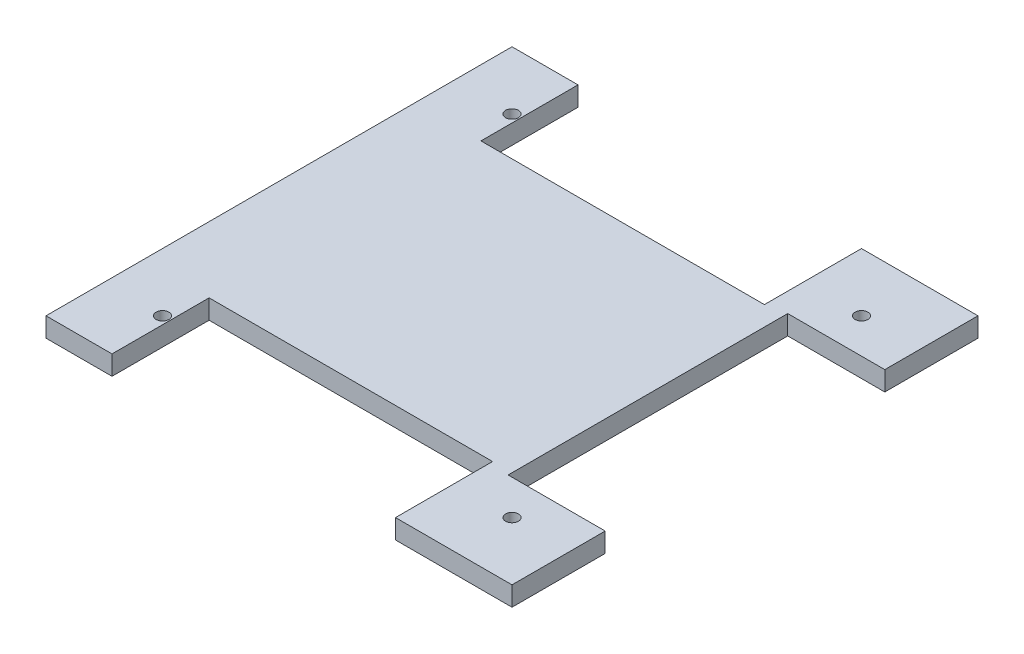
ISO-10303-21;
HEADER;
FILE_DESCRIPTION(('STEP AP214'),'2;1');
FILE_NAME('part.step','',(''),(''),'','','');
FILE_SCHEMA(('AUTOMOTIVE_DESIGN { 1 0 10303 214 1 1 1 1 }'));
ENDSEC;
DATA;
#1=APPLICATION_CONTEXT('core data for automotive mechanical design processes');
#2=APPLICATION_PROTOCOL_DEFINITION('international standard','automotive_design',2000,#1);
#3=PRODUCT_CONTEXT('',#1,'mechanical');
#4=PRODUCT('Part','Part','',(#3));
#5=PRODUCT_RELATED_PRODUCT_CATEGORY('part','',(#4));
#6=PRODUCT_DEFINITION_FORMATION('','',#4);
#7=PRODUCT_DEFINITION_CONTEXT('part definition',#1,'design');
#8=PRODUCT_DEFINITION('design','',#6,#7);
#9=PRODUCT_DEFINITION_SHAPE('','',#8);
#10=(LENGTH_UNIT() NAMED_UNIT(*) SI_UNIT(.MILLI.,.METRE.));
#11=(NAMED_UNIT(*) PLANE_ANGLE_UNIT() SI_UNIT($,.RADIAN.));
#12=(NAMED_UNIT(*) SI_UNIT($,.STERADIAN.) SOLID_ANGLE_UNIT());
#13=UNCERTAINTY_MEASURE_WITH_UNIT(LENGTH_MEASURE(1.E-05),#10,'distance_accuracy_value','');
#14=(GEOMETRIC_REPRESENTATION_CONTEXT(3) GLOBAL_UNCERTAINTY_ASSIGNED_CONTEXT((#13)) GLOBAL_UNIT_ASSIGNED_CONTEXT((#10,
#11,#12)) REPRESENTATION_CONTEXT('',''));
#15=CARTESIAN_POINT('',(0.,0.,0.));
#16=DIRECTION('',(0.,0.,1.));
#17=DIRECTION('',(1.,0.,0.));
#18=AXIS2_PLACEMENT_3D('',#15,#16,#17);
#19=CARTESIAN_POINT('',(60.,5.,-36.));
#20=DIRECTION('',(-1.,0.,0.));
#21=DIRECTION('',(0.,0.,1.));
#22=AXIS2_PLACEMENT_3D('',#19,#20,#21);
#23=PLANE('',#22);
#24=DIRECTION('',(0.,0.,-1.));
#25=VECTOR('',#24,1.);
#26=CARTESIAN_POINT('',(60.,0.,-36.));
#27=LINE('',#26,#25);
#28=CARTESIAN_POINT('',(60.,0.,-36.));
#29=VERTEX_POINT('',#28);
#30=CARTESIAN_POINT('',(60.,0.,-60.));
#31=VERTEX_POINT('',#30);
#32=EDGE_CURVE('E176',#29,#31,#27,.T.);
#33=ORIENTED_EDGE('',*,*,#32,.T.);
#34=DIRECTION('',(0.,-1.,0.));
#35=VECTOR('',#34,1.);
#36=CARTESIAN_POINT('',(60.,5.,-60.));
#37=LINE('',#36,#35);
#38=CARTESIAN_POINT('',(60.,5.,-60.));
#39=VERTEX_POINT('',#38);
#40=EDGE_CURVE('E11',#39,#31,#37,.T.);
#41=ORIENTED_EDGE('',*,*,#40,.F.);
#42=DIRECTION('',(0.,0.,-1.));
#43=VECTOR('',#42,1.);
#44=CARTESIAN_POINT('',(60.,5.,-36.));
#45=LINE('',#44,#43);
#46=CARTESIAN_POINT('',(60.,5.,-36.));
#47=VERTEX_POINT('',#46);
#48=EDGE_CURVE('E207',#47,#39,#45,.T.);
#49=ORIENTED_EDGE('',*,*,#48,.F.);
#50=DIRECTION('',(0.,-1.,0.));
#51=VECTOR('',#50,1.);
#52=CARTESIAN_POINT('',(60.,5.,-36.));
#53=LINE('',#52,#51);
#54=EDGE_CURVE('E172',#47,#29,#53,.T.);
#55=ORIENTED_EDGE('',*,*,#54,.T.);
#56=EDGE_LOOP('',(#33,#41,#49,#55));
#57=FACE_BOUND('',#56,.T.);
#58=ADVANCED_FACE('F32',(#57),#23,.F.);
#59=CARTESIAN_POINT('',(30.,5.,-60.));
#60=DIRECTION('',(0.,0.,1.));
#61=DIRECTION('',(1.,0.,0.));
#62=AXIS2_PLACEMENT_3D('',#59,#60,#61);
#63=PLANE('',#62);
#64=DIRECTION('',(-1.,0.,0.));
#65=VECTOR('',#64,1.);
#66=CARTESIAN_POINT('',(30.,0.,-60.));
#67=LINE('',#66,#65);
#68=CARTESIAN_POINT('',(30.,0.,-60.));
#69=VERTEX_POINT('',#68);
#70=EDGE_CURVE('E179',#31,#69,#67,.T.);
#71=ORIENTED_EDGE('',*,*,#70,.T.);
#72=DIRECTION('',(0.,-1.,0.));
#73=VECTOR('',#72,1.);
#74=CARTESIAN_POINT('',(30.,5.,-60.));
#75=LINE('',#74,#73);
#76=CARTESIAN_POINT('',(30.,5.,-60.));
#77=VERTEX_POINT('',#76);
#78=EDGE_CURVE('E40',#77,#69,#75,.T.);
#79=ORIENTED_EDGE('',*,*,#78,.F.);
#80=DIRECTION('',(-1.,0.,0.));
#81=VECTOR('',#80,1.);
#82=CARTESIAN_POINT('',(30.,5.,-60.));
#83=LINE('',#82,#81);
#84=EDGE_CURVE('E115',#39,#77,#83,.T.);
#85=ORIENTED_EDGE('',*,*,#84,.F.);
#86=ORIENTED_EDGE('',*,*,#40,.T.);
#87=EDGE_LOOP('',(#71,#79,#85,#86));
#88=FACE_BOUND('',#87,.T.);
#89=ADVANCED_FACE('F306',(#88),#63,.F.);
#90=CARTESIAN_POINT('',(30.,5.,-35.));
#91=DIRECTION('',(1.,0.,0.));
#92=DIRECTION('',(0.,0.,-1.));
#93=AXIS2_PLACEMENT_3D('',#90,#91,#92);
#94=PLANE('',#93);
#95=DIRECTION('',(0.,0.,1.));
#96=VECTOR('',#95,1.);
#97=CARTESIAN_POINT('',(30.,0.,-35.));
#98=LINE('',#97,#96);
#99=CARTESIAN_POINT('',(30.,0.,-35.));
#100=VERTEX_POINT('',#99);
#101=EDGE_CURVE('E182',#69,#100,#98,.T.);
#102=ORIENTED_EDGE('',*,*,#101,.T.);
#103=DIRECTION('',(0.,-1.,0.));
#104=VECTOR('',#103,1.);
#105=CARTESIAN_POINT('',(30.,5.,-35.));
#106=LINE('',#105,#104);
#107=CARTESIAN_POINT('',(30.,5.,-35.));
#108=VERTEX_POINT('',#107);
#109=EDGE_CURVE('E238',#108,#100,#106,.T.);
#110=ORIENTED_EDGE('',*,*,#109,.F.);
#111=DIRECTION('',(0.,0.,1.));
#112=VECTOR('',#111,1.);
#113=CARTESIAN_POINT('',(30.,5.,-35.));
#114=LINE('',#113,#112);
#115=EDGE_CURVE('E246',#77,#108,#114,.T.);
#116=ORIENTED_EDGE('',*,*,#115,.F.);
#117=ORIENTED_EDGE('',*,*,#78,.T.);
#118=EDGE_LOOP('',(#102,#110,#116,#117));
#119=FACE_BOUND('',#118,.T.);
#120=ADVANCED_FACE('F244',(#119),#94,.F.);
#121=CARTESIAN_POINT('',(-43.,5.,-35.));
#122=DIRECTION('',(0.,0.,1.));
#123=DIRECTION('',(1.,0.,0.));
#124=AXIS2_PLACEMENT_3D('',#121,#122,#123);
#125=PLANE('',#124);
#126=DIRECTION('',(-1.,0.,0.));
#127=VECTOR('',#126,1.);
#128=CARTESIAN_POINT('',(-43.,0.,-35.));
#129=LINE('',#128,#127);
#130=CARTESIAN_POINT('',(-43.,0.,-35.));
#131=VERTEX_POINT('',#130);
#132=EDGE_CURVE('E184',#100,#131,#129,.T.);
#133=ORIENTED_EDGE('',*,*,#132,.T.);
#134=DIRECTION('',(0.,-1.,0.));
#135=VECTOR('',#134,1.);
#136=CARTESIAN_POINT('',(-43.,5.,-35.));
#137=LINE('',#136,#135);
#138=CARTESIAN_POINT('',(-43.,5.,-35.));
#139=VERTEX_POINT('',#138);
#140=EDGE_CURVE('E235',#139,#131,#137,.T.);
#141=ORIENTED_EDGE('',*,*,#140,.F.);
#142=DIRECTION('',(-1.,0.,0.));
#143=VECTOR('',#142,1.);
#144=CARTESIAN_POINT('',(-43.,5.,-35.));
#145=LINE('',#144,#143);
#146=EDGE_CURVE('E264',#108,#139,#145,.T.);
#147=ORIENTED_EDGE('',*,*,#146,.F.);
#148=ORIENTED_EDGE('',*,*,#109,.T.);
#149=EDGE_LOOP('',(#133,#141,#147,#148));
#150=FACE_BOUND('',#149,.T.);
#151=ADVANCED_FACE('F255',(#150),#125,.F.);
#152=CARTESIAN_POINT('',(-43.,5.,-60.));
#153=DIRECTION('',(-1.,0.,0.));
#154=DIRECTION('',(0.,0.,1.));
#155=AXIS2_PLACEMENT_3D('',#152,#153,#154);
#156=PLANE('',#155);
#157=DIRECTION('',(0.,0.,-1.));
#158=VECTOR('',#157,1.);
#159=CARTESIAN_POINT('',(-43.,0.,-60.));
#160=LINE('',#159,#158);
#161=CARTESIAN_POINT('',(-43.,0.,-60.));
#162=VERTEX_POINT('',#161);
#163=EDGE_CURVE('E186',#131,#162,#160,.T.);
#164=ORIENTED_EDGE('',*,*,#163,.T.);
#165=DIRECTION('',(0.,-1.,0.));
#166=VECTOR('',#165,1.);
#167=CARTESIAN_POINT('',(-43.,5.,-60.));
#168=LINE('',#167,#166);
#169=CARTESIAN_POINT('',(-43.,5.,-60.));
#170=VERTEX_POINT('',#169);
#171=EDGE_CURVE('E232',#170,#162,#168,.T.);
#172=ORIENTED_EDGE('',*,*,#171,.F.);
#173=DIRECTION('',(0.,0.,-1.));
#174=VECTOR('',#173,1.);
#175=CARTESIAN_POINT('',(-43.,5.,-60.));
#176=LINE('',#175,#174);
#177=EDGE_CURVE('E261',#139,#170,#176,.T.);
#178=ORIENTED_EDGE('',*,*,#177,.F.);
#179=ORIENTED_EDGE('',*,*,#140,.T.);
#180=EDGE_LOOP('',(#164,#172,#178,#179));
#181=FACE_BOUND('',#180,.T.);
#182=ADVANCED_FACE('F259',(#181),#156,.F.);
#183=CARTESIAN_POINT('',(-60.,5.,-60.));
#184=DIRECTION('',(0.,0.,1.));
#185=DIRECTION('',(1.,0.,0.));
#186=AXIS2_PLACEMENT_3D('',#183,#184,#185);
#187=PLANE('',#186);
#188=DIRECTION('',(-1.,0.,0.));
#189=VECTOR('',#188,1.);
#190=CARTESIAN_POINT('',(-60.,0.,-60.));
#191=LINE('',#190,#189);
#192=CARTESIAN_POINT('',(-60.,0.,-60.));
#193=VERTEX_POINT('',#192);
#194=EDGE_CURVE('E188',#162,#193,#191,.T.);
#195=ORIENTED_EDGE('',*,*,#194,.T.);
#196=DIRECTION('',(0.,-1.,0.));
#197=VECTOR('',#196,1.);
#198=CARTESIAN_POINT('',(-60.,5.,-60.));
#199=LINE('',#198,#197);
#200=CARTESIAN_POINT('',(-60.,5.,-60.));
#201=VERTEX_POINT('',#200);
#202=EDGE_CURVE('E229',#201,#193,#199,.T.);
#203=ORIENTED_EDGE('',*,*,#202,.F.);
#204=DIRECTION('',(-1.,0.,0.));
#205=VECTOR('',#204,1.);
#206=CARTESIAN_POINT('',(-60.,5.,-60.));
#207=LINE('',#206,#205);
#208=EDGE_CURVE('E263',#170,#201,#207,.T.);
#209=ORIENTED_EDGE('',*,*,#208,.F.);
#210=ORIENTED_EDGE('',*,*,#171,.T.);
#211=EDGE_LOOP('',(#195,#203,#209,#210));
#212=FACE_BOUND('',#211,.T.);
#213=ADVANCED_FACE('F319',(#212),#187,.F.);
#214=CARTESIAN_POINT('',(-60.,5.,60.));
#215=DIRECTION('',(1.,0.,0.));
#216=DIRECTION('',(0.,0.,-1.));
#217=AXIS2_PLACEMENT_3D('',#214,#215,#216);
#218=PLANE('',#217);
#219=DIRECTION('',(0.,0.,1.));
#220=VECTOR('',#219,1.);
#221=CARTESIAN_POINT('',(-60.,0.,60.));
#222=LINE('',#221,#220);
#223=CARTESIAN_POINT('',(-60.,0.,60.));
#224=VERTEX_POINT('',#223);
#225=EDGE_CURVE('E190',#193,#224,#222,.T.);
#226=ORIENTED_EDGE('',*,*,#225,.T.);
#227=DIRECTION('',(0.,-1.,0.));
#228=VECTOR('',#227,1.);
#229=CARTESIAN_POINT('',(-60.,5.,60.));
#230=LINE('',#229,#228);
#231=CARTESIAN_POINT('',(-60.,5.,60.));
#232=VERTEX_POINT('',#231);
#233=EDGE_CURVE('E226',#232,#224,#230,.T.);
#234=ORIENTED_EDGE('',*,*,#233,.F.);
#235=DIRECTION('',(0.,0.,1.));
#236=VECTOR('',#235,1.);
#237=CARTESIAN_POINT('',(-60.,5.,60.));
#238=LINE('',#237,#236);
#239=EDGE_CURVE('E266',#201,#232,#238,.T.);
#240=ORIENTED_EDGE('',*,*,#239,.F.);
#241=ORIENTED_EDGE('',*,*,#202,.T.);
#242=EDGE_LOOP('',(#226,#234,#240,#241));
#243=FACE_BOUND('',#242,.T.);
#244=ADVANCED_FACE('F322',(#243),#218,.F.);
#245=CARTESIAN_POINT('',(-60.,5.,60.));
#246=DIRECTION('',(0.,0.,-1.));
#247=DIRECTION('',(-1.,0.,0.));
#248=AXIS2_PLACEMENT_3D('',#245,#246,#247);
#249=PLANE('',#248);
#250=DIRECTION('',(1.,0.,0.));
#251=VECTOR('',#250,1.);
#252=CARTESIAN_POINT('',(-60.,0.,60.));
#253=LINE('',#252,#251);
#254=CARTESIAN_POINT('',(-43.,0.,60.));
#255=VERTEX_POINT('',#254);
#256=EDGE_CURVE('E192',#224,#255,#253,.T.);
#257=ORIENTED_EDGE('',*,*,#256,.T.);
#258=DIRECTION('',(0.,-1.,0.));
#259=VECTOR('',#258,1.);
#260=CARTESIAN_POINT('',(-43.,5.,60.));
#261=LINE('',#260,#259);
#262=CARTESIAN_POINT('',(-43.,5.,60.));
#263=VERTEX_POINT('',#262);
#264=EDGE_CURVE('E223',#263,#255,#261,.T.);
#265=ORIENTED_EDGE('',*,*,#264,.F.);
#266=DIRECTION('',(1.,0.,0.));
#267=VECTOR('',#266,1.);
#268=CARTESIAN_POINT('',(-60.,5.,60.));
#269=LINE('',#268,#267);
#270=EDGE_CURVE('E272',#232,#263,#269,.T.);
#271=ORIENTED_EDGE('',*,*,#270,.F.);
#272=ORIENTED_EDGE('',*,*,#233,.T.);
#273=EDGE_LOOP('',(#257,#265,#271,#272));
#274=FACE_BOUND('',#273,.T.);
#275=ADVANCED_FACE('F326',(#274),#249,.F.);
#276=CARTESIAN_POINT('',(-43.,5.,60.));
#277=DIRECTION('',(-1.,0.,0.));
#278=DIRECTION('',(0.,0.,1.));
#279=AXIS2_PLACEMENT_3D('',#276,#277,#278);
#280=PLANE('',#279);
#281=DIRECTION('',(0.,0.,-1.));
#282=VECTOR('',#281,1.);
#283=CARTESIAN_POINT('',(-43.,0.,60.));
#284=LINE('',#283,#282);
#285=CARTESIAN_POINT('',(-43.,0.,35.));
#286=VERTEX_POINT('',#285);
#287=EDGE_CURVE('E194',#255,#286,#284,.T.);
#288=ORIENTED_EDGE('',*,*,#287,.T.);
#289=DIRECTION('',(0.,-1.,0.));
#290=VECTOR('',#289,1.);
#291=CARTESIAN_POINT('',(-43.,5.,35.));
#292=LINE('',#291,#290);
#293=CARTESIAN_POINT('',(-43.,5.,35.));
#294=VERTEX_POINT('',#293);
#295=EDGE_CURVE('E220',#294,#286,#292,.T.);
#296=ORIENTED_EDGE('',*,*,#295,.F.);
#297=DIRECTION('',(0.,0.,-1.));
#298=VECTOR('',#297,1.);
#299=CARTESIAN_POINT('',(-43.,5.,60.));
#300=LINE('',#299,#298);
#301=EDGE_CURVE('E274',#263,#294,#300,.T.);
#302=ORIENTED_EDGE('',*,*,#301,.F.);
#303=ORIENTED_EDGE('',*,*,#264,.T.);
#304=EDGE_LOOP('',(#288,#296,#302,#303));
#305=FACE_BOUND('',#304,.T.);
#306=ADVANCED_FACE('F330',(#305),#280,.F.);
#307=CARTESIAN_POINT('',(-43.,5.,35.));
#308=DIRECTION('',(0.,0.,-1.));
#309=DIRECTION('',(-1.,0.,0.));
#310=AXIS2_PLACEMENT_3D('',#307,#308,#309);
#311=PLANE('',#310);
#312=DIRECTION('',(1.,0.,0.));
#313=VECTOR('',#312,1.);
#314=CARTESIAN_POINT('',(-43.,0.,35.));
#315=LINE('',#314,#313);
#316=CARTESIAN_POINT('',(30.,0.,35.));
#317=VERTEX_POINT('',#316);
#318=EDGE_CURVE('E196',#286,#317,#315,.T.);
#319=ORIENTED_EDGE('',*,*,#318,.T.);
#320=DIRECTION('',(0.,-1.,0.));
#321=VECTOR('',#320,1.);
#322=CARTESIAN_POINT('',(30.,5.,35.));
#323=LINE('',#322,#321);
#324=CARTESIAN_POINT('',(30.,5.,35.));
#325=VERTEX_POINT('',#324);
#326=EDGE_CURVE('E217',#325,#317,#323,.T.);
#327=ORIENTED_EDGE('',*,*,#326,.F.);
#328=DIRECTION('',(1.,0.,0.));
#329=VECTOR('',#328,1.);
#330=CARTESIAN_POINT('',(-43.,5.,35.));
#331=LINE('',#330,#329);
#332=EDGE_CURVE('E276',#294,#325,#331,.T.);
#333=ORIENTED_EDGE('',*,*,#332,.F.);
#334=ORIENTED_EDGE('',*,*,#295,.T.);
#335=EDGE_LOOP('',(#319,#327,#333,#334));
#336=FACE_BOUND('',#335,.T.);
#337=ADVANCED_FACE('F334',(#336),#311,.F.);
#338=CARTESIAN_POINT('',(30.,5.,35.));
#339=DIRECTION('',(1.,0.,0.));
#340=DIRECTION('',(0.,0.,-1.));
#341=AXIS2_PLACEMENT_3D('',#338,#339,#340);
#342=PLANE('',#341);
#343=DIRECTION('',(0.,0.,1.));
#344=VECTOR('',#343,1.);
#345=CARTESIAN_POINT('',(30.,0.,35.));
#346=LINE('',#345,#344);
#347=CARTESIAN_POINT('',(30.,0.,60.));
#348=VERTEX_POINT('',#347);
#349=EDGE_CURVE('E198',#317,#348,#346,.T.);
#350=ORIENTED_EDGE('',*,*,#349,.T.);
#351=DIRECTION('',(0.,-1.,0.));
#352=VECTOR('',#351,1.);
#353=CARTESIAN_POINT('',(30.,5.,60.));
#354=LINE('',#353,#352);
#355=CARTESIAN_POINT('',(30.,5.,60.));
#356=VERTEX_POINT('',#355);
#357=EDGE_CURVE('E214',#356,#348,#354,.T.);
#358=ORIENTED_EDGE('',*,*,#357,.F.);
#359=DIRECTION('',(0.,0.,1.));
#360=VECTOR('',#359,1.);
#361=CARTESIAN_POINT('',(30.,5.,35.));
#362=LINE('',#361,#360);
#363=EDGE_CURVE('E278',#325,#356,#362,.T.);
#364=ORIENTED_EDGE('',*,*,#363,.F.);
#365=ORIENTED_EDGE('',*,*,#326,.T.);
#366=EDGE_LOOP('',(#350,#358,#364,#365));
#367=FACE_BOUND('',#366,.T.);
#368=ADVANCED_FACE('F338',(#367),#342,.F.);
#369=CARTESIAN_POINT('',(30.,5.,60.));
#370=DIRECTION('',(0.,0.,-1.));
#371=DIRECTION('',(-1.,0.,0.));
#372=AXIS2_PLACEMENT_3D('',#369,#370,#371);
#373=PLANE('',#372);
#374=DIRECTION('',(1.,0.,0.));
#375=VECTOR('',#374,1.);
#376=CARTESIAN_POINT('',(30.,0.,60.));
#377=LINE('',#376,#375);
#378=CARTESIAN_POINT('',(60.,0.,60.));
#379=VERTEX_POINT('',#378);
#380=EDGE_CURVE('E200',#348,#379,#377,.T.);
#381=ORIENTED_EDGE('',*,*,#380,.T.);
#382=DIRECTION('',(0.,-1.,0.));
#383=VECTOR('',#382,1.);
#384=CARTESIAN_POINT('',(60.,5.,60.));
#385=LINE('',#384,#383);
#386=CARTESIAN_POINT('',(60.,5.,60.));
#387=VERTEX_POINT('',#386);
#388=EDGE_CURVE('E211',#387,#379,#385,.T.);
#389=ORIENTED_EDGE('',*,*,#388,.F.);
#390=DIRECTION('',(1.,0.,0.));
#391=VECTOR('',#390,1.);
#392=CARTESIAN_POINT('',(30.,5.,60.));
#393=LINE('',#392,#391);
#394=EDGE_CURVE('E280',#356,#387,#393,.T.);
#395=ORIENTED_EDGE('',*,*,#394,.F.);
#396=ORIENTED_EDGE('',*,*,#357,.T.);
#397=EDGE_LOOP('',(#381,#389,#395,#396));
#398=FACE_BOUND('',#397,.T.);
#399=ADVANCED_FACE('F286',(#398),#373,.F.);
#400=CARTESIAN_POINT('',(60.,5.,60.));
#401=DIRECTION('',(-1.,0.,0.));
#402=DIRECTION('',(0.,0.,1.));
#403=AXIS2_PLACEMENT_3D('',#400,#401,#402);
#404=PLANE('',#403);
#405=DIRECTION('',(0.,0.,-1.));
#406=VECTOR('',#405,1.);
#407=CARTESIAN_POINT('',(60.,0.,60.));
#408=LINE('',#407,#406);
#409=CARTESIAN_POINT('',(60.,0.,36.));
#410=VERTEX_POINT('',#409);
#411=EDGE_CURVE('E202',#379,#410,#408,.T.);
#412=ORIENTED_EDGE('',*,*,#411,.T.);
#413=DIRECTION('',(0.,-1.,0.));
#414=VECTOR('',#413,1.);
#415=CARTESIAN_POINT('',(60.,5.,36.));
#416=LINE('',#415,#414);
#417=CARTESIAN_POINT('',(60.,5.,36.));
#418=VERTEX_POINT('',#417);
#419=EDGE_CURVE('E167',#418,#410,#416,.T.);
#420=ORIENTED_EDGE('',*,*,#419,.F.);
#421=DIRECTION('',(0.,0.,-1.));
#422=VECTOR('',#421,1.);
#423=CARTESIAN_POINT('',(60.,5.,60.));
#424=LINE('',#423,#422);
#425=EDGE_CURVE('E158',#387,#418,#424,.T.);
#426=ORIENTED_EDGE('',*,*,#425,.F.);
#427=ORIENTED_EDGE('',*,*,#388,.T.);
#428=EDGE_LOOP('',(#412,#420,#426,#427));
#429=FACE_BOUND('',#428,.T.);
#430=ADVANCED_FACE('F290',(#429),#404,.F.);
#431=CARTESIAN_POINT('',(35.,5.,36.));
#432=DIRECTION('',(0.,0.,1.));
#433=DIRECTION('',(1.,0.,0.));
#434=AXIS2_PLACEMENT_3D('',#431,#432,#433);
#435=PLANE('',#434);
#436=DIRECTION('',(-1.,0.,0.));
#437=VECTOR('',#436,1.);
#438=CARTESIAN_POINT('',(35.,0.,36.));
#439=LINE('',#438,#437);
#440=CARTESIAN_POINT('',(35.,0.,36.));
#441=VERTEX_POINT('',#440);
#442=EDGE_CURVE('E166',#410,#441,#439,.T.);
#443=ORIENTED_EDGE('',*,*,#442,.T.);
#444=DIRECTION('',(0.,-1.,0.));
#445=VECTOR('',#444,1.);
#446=CARTESIAN_POINT('',(35.,5.,36.));
#447=LINE('',#446,#445);
#448=CARTESIAN_POINT('',(35.,5.,36.));
#449=VERTEX_POINT('',#448);
#450=EDGE_CURVE('E163',#449,#441,#447,.T.);
#451=ORIENTED_EDGE('',*,*,#450,.F.);
#452=DIRECTION('',(-1.,0.,0.));
#453=VECTOR('',#452,1.);
#454=CARTESIAN_POINT('',(35.,5.,36.));
#455=LINE('',#454,#453);
#456=EDGE_CURVE('E152',#418,#449,#455,.T.);
#457=ORIENTED_EDGE('',*,*,#456,.F.);
#458=ORIENTED_EDGE('',*,*,#419,.T.);
#459=EDGE_LOOP('',(#443,#451,#457,#458));
#460=FACE_BOUND('',#459,.T.);
#461=ADVANCED_FACE('F164',(#460),#435,.F.);
#462=CARTESIAN_POINT('',(35.,5.,-36.));
#463=DIRECTION('',(-1.,0.,0.));
#464=DIRECTION('',(0.,0.,1.));
#465=AXIS2_PLACEMENT_3D('',#462,#463,#464);
#466=PLANE('',#465);
#467=DIRECTION('',(0.,0.,-1.));
#468=VECTOR('',#467,1.);
#469=CARTESIAN_POINT('',(35.,0.,-36.));
#470=LINE('',#469,#468);
#471=CARTESIAN_POINT('',(35.,0.,-36.));
#472=VERTEX_POINT('',#471);
#473=EDGE_CURVE('E101',#441,#472,#470,.T.);
#474=ORIENTED_EDGE('',*,*,#473,.T.);
#475=DIRECTION('',(0.,-1.,0.));
#476=VECTOR('',#475,1.);
#477=CARTESIAN_POINT('',(35.,5.,-36.));
#478=LINE('',#477,#476);
#479=CARTESIAN_POINT('',(35.,5.,-36.));
#480=VERTEX_POINT('',#479);
#481=EDGE_CURVE('E168',#480,#472,#478,.T.);
#482=ORIENTED_EDGE('',*,*,#481,.F.);
#483=DIRECTION('',(0.,0.,-1.));
#484=VECTOR('',#483,1.);
#485=CARTESIAN_POINT('',(35.,5.,-36.));
#486=LINE('',#485,#484);
#487=EDGE_CURVE('E156',#449,#480,#486,.T.);
#488=ORIENTED_EDGE('',*,*,#487,.F.);
#489=ORIENTED_EDGE('',*,*,#450,.T.);
#490=EDGE_LOOP('',(#474,#482,#488,#489));
#491=FACE_BOUND('',#490,.T.);
#492=ADVANCED_FACE('F170',(#491),#466,.F.);
#493=CARTESIAN_POINT('',(60.,5.,-36.));
#494=DIRECTION('',(0.,0.,-1.));
#495=DIRECTION('',(-1.,0.,0.));
#496=AXIS2_PLACEMENT_3D('',#493,#494,#495);
#497=PLANE('',#496);
#498=DIRECTION('',(1.,0.,0.));
#499=VECTOR('',#498,1.);
#500=CARTESIAN_POINT('',(60.,0.,-36.));
#501=LINE('',#500,#499);
#502=EDGE_CURVE('E107',#472,#29,#501,.T.);
#503=ORIENTED_EDGE('',*,*,#502,.T.);
#504=ORIENTED_EDGE('',*,*,#54,.F.);
#505=DIRECTION('',(1.,0.,0.));
#506=VECTOR('',#505,1.);
#507=CARTESIAN_POINT('',(60.,5.,-36.));
#508=LINE('',#507,#506);
#509=EDGE_CURVE('E48',#480,#47,#508,.T.);
#510=ORIENTED_EDGE('',*,*,#509,.F.);
#511=ORIENTED_EDGE('',*,*,#481,.T.);
#512=EDGE_LOOP('',(#503,#504,#510,#511));
#513=FACE_BOUND('',#512,.T.);
#514=ADVANCED_FACE('F294',(#513),#497,.F.);
#515=CARTESIAN_POINT('',(0.,5.,0.));
#516=DIRECTION('',(0.,-1.,0.));
#517=DIRECTION('',(0.,0.,-1.));
#518=AXIS2_PLACEMENT_3D('',#515,#516,#517);
#519=PLANE('',#518);
#520=CARTESIAN_POINT('',(-45.,5.,-45.));
#521=DIRECTION('',(0.,1.,0.));
#522=DIRECTION('',(0.,0.,1.));
#523=AXIS2_PLACEMENT_3D('',#520,#521,#522);
#524=CIRCLE('',#523,1.64999999999999);
#525=CARTESIAN_POINT('',(-45.,5.,-43.35));
#526=VERTEX_POINT('',#525);
#527=EDGE_CURVE('E424',#526,#526,#524,.T.);
#528=ORIENTED_EDGE('',*,*,#527,.F.);
#529=EDGE_LOOP('',(#528));
#530=FACE_BOUND('',#529,.T.);
#531=CARTESIAN_POINT('',(45.,5.,-45.));
#532=DIRECTION('',(0.,1.,0.));
#533=DIRECTION('',(0.,0.,1.));
#534=AXIS2_PLACEMENT_3D('',#531,#532,#533);
#535=CIRCLE('',#534,1.64999999999999);
#536=CARTESIAN_POINT('',(45.,5.,-43.35));
#537=VERTEX_POINT('',#536);
#538=EDGE_CURVE('E426',#537,#537,#535,.T.);
#539=ORIENTED_EDGE('',*,*,#538,.F.);
#540=EDGE_LOOP('',(#539));
#541=FACE_BOUND('',#540,.T.);
#542=CARTESIAN_POINT('',(45.,5.,45.));
#543=DIRECTION('',(0.,1.,0.));
#544=DIRECTION('',(0.,0.,1.));
#545=AXIS2_PLACEMENT_3D('',#542,#543,#544);
#546=CIRCLE('',#545,1.64999999999999);
#547=CARTESIAN_POINT('',(45.,5.,46.65));
#548=VERTEX_POINT('',#547);
#549=EDGE_CURVE('E434',#548,#548,#546,.T.);
#550=ORIENTED_EDGE('',*,*,#549,.F.);
#551=EDGE_LOOP('',(#550));
#552=FACE_BOUND('',#551,.T.);
#553=CARTESIAN_POINT('',(-45.,5.,45.));
#554=DIRECTION('',(0.,1.,0.));
#555=DIRECTION('',(0.,0.,1.));
#556=AXIS2_PLACEMENT_3D('',#553,#554,#555);
#557=CIRCLE('',#556,1.64999999999999);
#558=CARTESIAN_POINT('',(-45.,5.,46.65));
#559=VERTEX_POINT('',#558);
#560=EDGE_CURVE('E440',#559,#559,#557,.T.);
#561=ORIENTED_EDGE('',*,*,#560,.F.);
#562=EDGE_LOOP('',(#561));
#563=FACE_BOUND('',#562,.T.);
#564=ORIENTED_EDGE('',*,*,#48,.T.);
#565=ORIENTED_EDGE('',*,*,#84,.T.);
#566=ORIENTED_EDGE('',*,*,#115,.T.);
#567=ORIENTED_EDGE('',*,*,#146,.T.);
#568=ORIENTED_EDGE('',*,*,#177,.T.);
#569=ORIENTED_EDGE('',*,*,#208,.T.);
#570=ORIENTED_EDGE('',*,*,#239,.T.);
#571=ORIENTED_EDGE('',*,*,#270,.T.);
#572=ORIENTED_EDGE('',*,*,#301,.T.);
#573=ORIENTED_EDGE('',*,*,#332,.T.);
#574=ORIENTED_EDGE('',*,*,#363,.T.);
#575=ORIENTED_EDGE('',*,*,#394,.T.);
#576=ORIENTED_EDGE('',*,*,#425,.T.);
#577=ORIENTED_EDGE('',*,*,#456,.T.);
#578=ORIENTED_EDGE('',*,*,#487,.T.);
#579=ORIENTED_EDGE('',*,*,#509,.T.);
#580=EDGE_LOOP('',(#564,#565,#566,#567,#568,#569,#570,#571,#572,#573,#574,#575,#576,#577,#578,#579));
#581=FACE_BOUND('',#580,.T.);
#582=ADVANCED_FACE('F154',(#530,#541,#552,#563,#581),#519,.F.);
#583=CARTESIAN_POINT('',(0.,0.,0.));
#584=DIRECTION('',(0.,-1.,0.));
#585=DIRECTION('',(0.,0.,-1.));
#586=AXIS2_PLACEMENT_3D('',#583,#584,#585);
#587=PLANE('',#586);
#588=CARTESIAN_POINT('',(-45.,0.,-45.));
#589=DIRECTION('',(0.,1.,0.));
#590=DIRECTION('',(0.,0.,1.));
#591=AXIS2_PLACEMENT_3D('',#588,#589,#590);
#592=CIRCLE('',#591,1.64999999999999);
#593=CARTESIAN_POINT('',(-45.,0.,-43.35));
#594=VERTEX_POINT('',#593);
#595=EDGE_CURVE('E421',#594,#594,#592,.T.);
#596=ORIENTED_EDGE('',*,*,#595,.T.);
#597=EDGE_LOOP('',(#596));
#598=FACE_BOUND('',#597,.T.);
#599=CARTESIAN_POINT('',(45.,0.,-45.));
#600=DIRECTION('',(0.,1.,0.));
#601=DIRECTION('',(0.,0.,1.));
#602=AXIS2_PLACEMENT_3D('',#599,#600,#601);
#603=CIRCLE('',#602,1.64999999999999);
#604=CARTESIAN_POINT('',(45.,0.,-43.35));
#605=VERTEX_POINT('',#604);
#606=EDGE_CURVE('E431',#605,#605,#603,.T.);
#607=ORIENTED_EDGE('',*,*,#606,.T.);
#608=EDGE_LOOP('',(#607));
#609=FACE_BOUND('',#608,.T.);
#610=CARTESIAN_POINT('',(45.,0.,45.));
#611=DIRECTION('',(0.,1.,0.));
#612=DIRECTION('',(0.,0.,1.));
#613=AXIS2_PLACEMENT_3D('',#610,#611,#612);
#614=CIRCLE('',#613,1.64999999999999);
#615=CARTESIAN_POINT('',(45.,0.,46.65));
#616=VERTEX_POINT('',#615);
#617=EDGE_CURVE('E437',#616,#616,#614,.T.);
#618=ORIENTED_EDGE('',*,*,#617,.T.);
#619=EDGE_LOOP('',(#618));
#620=FACE_BOUND('',#619,.T.);
#621=CARTESIAN_POINT('',(-45.,0.,45.));
#622=DIRECTION('',(0.,1.,0.));
#623=DIRECTION('',(0.,0.,1.));
#624=AXIS2_PLACEMENT_3D('',#621,#622,#623);
#625=CIRCLE('',#624,1.64999999999999);
#626=CARTESIAN_POINT('',(-45.,0.,46.65));
#627=VERTEX_POINT('',#626);
#628=EDGE_CURVE('E180',#627,#627,#625,.T.);
#629=ORIENTED_EDGE('',*,*,#628,.T.);
#630=EDGE_LOOP('',(#629));
#631=FACE_BOUND('',#630,.T.);
#632=ORIENTED_EDGE('',*,*,#32,.F.);
#633=ORIENTED_EDGE('',*,*,#502,.F.);
#634=ORIENTED_EDGE('',*,*,#473,.F.);
#635=ORIENTED_EDGE('',*,*,#442,.F.);
#636=ORIENTED_EDGE('',*,*,#411,.F.);
#637=ORIENTED_EDGE('',*,*,#380,.F.);
#638=ORIENTED_EDGE('',*,*,#349,.F.);
#639=ORIENTED_EDGE('',*,*,#318,.F.);
#640=ORIENTED_EDGE('',*,*,#287,.F.);
#641=ORIENTED_EDGE('',*,*,#256,.F.);
#642=ORIENTED_EDGE('',*,*,#225,.F.);
#643=ORIENTED_EDGE('',*,*,#194,.F.);
#644=ORIENTED_EDGE('',*,*,#163,.F.);
#645=ORIENTED_EDGE('',*,*,#132,.F.);
#646=ORIENTED_EDGE('',*,*,#101,.F.);
#647=ORIENTED_EDGE('',*,*,#70,.F.);
#648=EDGE_LOOP('',(#632,#633,#634,#635,#636,#637,#638,#639,#640,#641,#642,#643,#644,#645,#646,#647));
#649=FACE_BOUND('',#648,.T.);
#650=ADVANCED_FACE('F250',(#598,#609,#620,#631,#649),#587,.T.);
#651=CARTESIAN_POINT('',(-45.,5.,45.));
#652=DIRECTION('',(0.,1.,0.));
#653=DIRECTION('',(0.,0.,1.));
#654=AXIS2_PLACEMENT_3D('',#651,#652,#653);
#655=CYLINDRICAL_SURFACE('',#654,1.64999999999999);
#656=ORIENTED_EDGE('',*,*,#628,.F.);
#657=EDGE_LOOP('',(#656));
#658=FACE_BOUND('',#657,.T.);
#659=ORIENTED_EDGE('',*,*,#560,.T.);
#660=EDGE_LOOP('',(#659));
#661=FACE_BOUND('',#660,.T.);
#662=ADVANCED_FACE('F375',(#658,#661),#655,.F.);
#663=CARTESIAN_POINT('',(45.,5.,45.));
#664=DIRECTION('',(0.,1.,0.));
#665=DIRECTION('',(0.,0.,1.));
#666=AXIS2_PLACEMENT_3D('',#663,#664,#665);
#667=CYLINDRICAL_SURFACE('',#666,1.64999999999999);
#668=ORIENTED_EDGE('',*,*,#617,.F.);
#669=EDGE_LOOP('',(#668));
#670=FACE_BOUND('',#669,.T.);
#671=ORIENTED_EDGE('',*,*,#549,.T.);
#672=EDGE_LOOP('',(#671));
#673=FACE_BOUND('',#672,.T.);
#674=ADVANCED_FACE('F384',(#670,#673),#667,.F.);
#675=CARTESIAN_POINT('',(45.,5.,-45.));
#676=DIRECTION('',(0.,1.,0.));
#677=DIRECTION('',(0.,0.,1.));
#678=AXIS2_PLACEMENT_3D('',#675,#676,#677);
#679=CYLINDRICAL_SURFACE('',#678,1.64999999999999);
#680=ORIENTED_EDGE('',*,*,#606,.F.);
#681=EDGE_LOOP('',(#680));
#682=FACE_BOUND('',#681,.T.);
#683=ORIENTED_EDGE('',*,*,#538,.T.);
#684=EDGE_LOOP('',(#683));
#685=FACE_BOUND('',#684,.T.);
#686=ADVANCED_FACE('F394',(#682,#685),#679,.F.);
#687=CARTESIAN_POINT('',(-45.,5.,-45.));
#688=DIRECTION('',(0.,1.,0.));
#689=DIRECTION('',(0.,0.,1.));
#690=AXIS2_PLACEMENT_3D('',#687,#688,#689);
#691=CYLINDRICAL_SURFACE('',#690,1.64999999999999);
#692=ORIENTED_EDGE('',*,*,#595,.F.);
#693=EDGE_LOOP('',(#692));
#694=FACE_BOUND('',#693,.T.);
#695=ORIENTED_EDGE('',*,*,#527,.T.);
#696=EDGE_LOOP('',(#695));
#697=FACE_BOUND('',#696,.T.);
#698=ADVANCED_FACE('F404',(#694,#697),#691,.F.);
#699=CLOSED_SHELL('',(#58,#89,#120,#151,#182,#213,#244,#275,#306,#337,#368,#399,#430,#461,#492,
#514,#582,#650,#662,#674,#686,#698));
#700=MANIFOLD_SOLID_BREP('B2',#699);
#701=ADVANCED_BREP_SHAPE_REPRESENTATION('',(#18,#700),#14);
#702=SHAPE_DEFINITION_REPRESENTATION(#9,#701);
ENDSEC;
END-ISO-10303-21;
